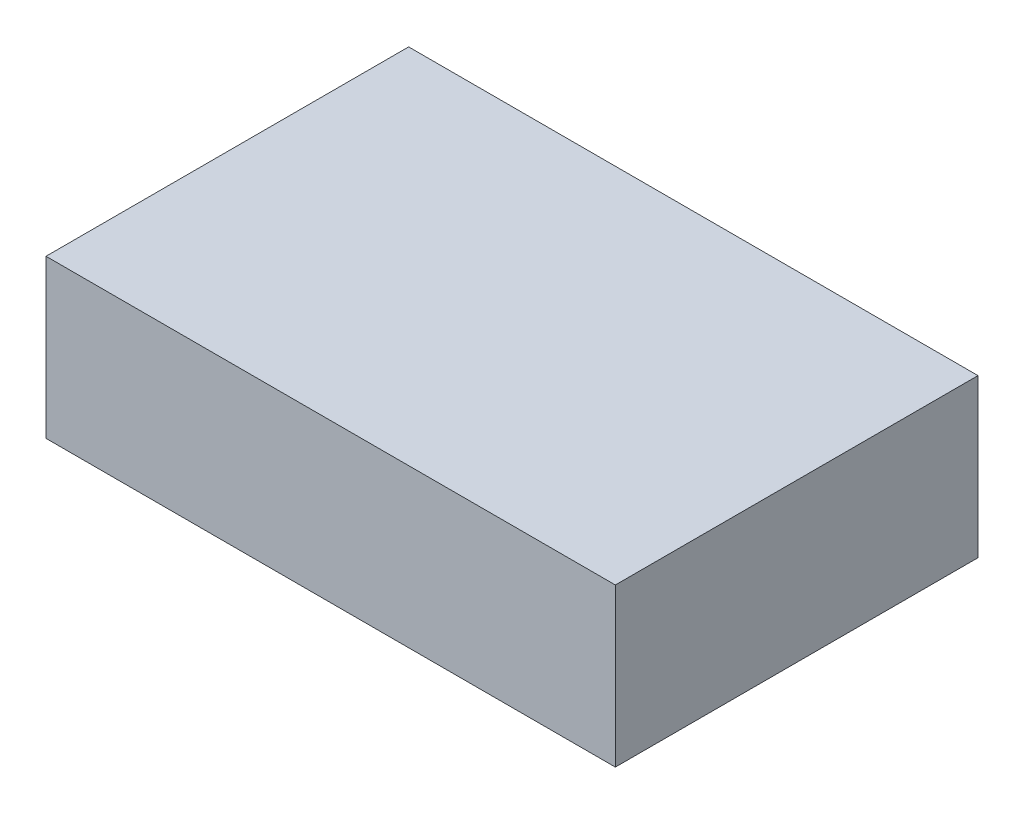
ISO-10303-21;
HEADER;
FILE_DESCRIPTION(('STEP AP214'),'2;1');
FILE_NAME('part.step','',(''),(''),'','','');
FILE_SCHEMA(('AUTOMOTIVE_DESIGN { 1 0 10303 214 1 1 1 1 }'));
ENDSEC;
DATA;
#1=APPLICATION_CONTEXT('core data for automotive mechanical design processes');
#2=APPLICATION_PROTOCOL_DEFINITION('international standard','automotive_design',2000,#1);
#3=PRODUCT_CONTEXT('',#1,'mechanical');
#4=PRODUCT('Part','Part','',(#3));
#5=PRODUCT_RELATED_PRODUCT_CATEGORY('part','',(#4));
#6=PRODUCT_DEFINITION_FORMATION('','',#4);
#7=PRODUCT_DEFINITION_CONTEXT('part definition',#1,'design');
#8=PRODUCT_DEFINITION('design','',#6,#7);
#9=PRODUCT_DEFINITION_SHAPE('','',#8);
#10=(LENGTH_UNIT() NAMED_UNIT(*) SI_UNIT(.MILLI.,.METRE.));
#11=(NAMED_UNIT(*) PLANE_ANGLE_UNIT() SI_UNIT($,.RADIAN.));
#12=(NAMED_UNIT(*) SI_UNIT($,.STERADIAN.) SOLID_ANGLE_UNIT());
#13=UNCERTAINTY_MEASURE_WITH_UNIT(LENGTH_MEASURE(1.E-05),#10,'distance_accuracy_value','');
#14=(GEOMETRIC_REPRESENTATION_CONTEXT(3) GLOBAL_UNCERTAINTY_ASSIGNED_CONTEXT((#13)) GLOBAL_UNIT_ASSIGNED_CONTEXT((#10,
#11,#12)) REPRESENTATION_CONTEXT('',''));
#15=CARTESIAN_POINT('',(0.,0.,0.));
#16=DIRECTION('',(0.,0.,1.));
#17=DIRECTION('',(1.,0.,0.));
#18=AXIS2_PLACEMENT_3D('',#15,#16,#17);
#19=CARTESIAN_POINT('',(0.,87.,0.));
#20=DIRECTION('',(0.,0.,-1.));
#21=DIRECTION('',(-1.,0.,0.));
#22=AXIS2_PLACEMENT_3D('',#19,#20,#21);
#23=PLANE('',#22);
#24=DIRECTION('',(1.,0.,0.));
#25=VECTOR('',#24,1.);
#26=CARTESIAN_POINT('',(0.,0.,0.));
#27=LINE('',#26,#25);
#28=CARTESIAN_POINT('',(0.,0.,0.));
#29=VERTEX_POINT('',#28);
#30=CARTESIAN_POINT('',(314.,0.,0.));
#31=VERTEX_POINT('',#30);
#32=EDGE_CURVE('E99',#29,#31,#27,.T.);
#33=ORIENTED_EDGE('',*,*,#32,.T.);
#34=DIRECTION('',(0.,-1.,0.));
#35=VECTOR('',#34,1.);
#36=CARTESIAN_POINT('',(314.,87.,0.));
#37=LINE('',#36,#35);
#38=CARTESIAN_POINT('',(314.,87.,0.));
#39=VERTEX_POINT('',#38);
#40=EDGE_CURVE('E11',#39,#31,#37,.T.);
#41=ORIENTED_EDGE('',*,*,#40,.F.);
#42=DIRECTION('',(1.,0.,0.));
#43=VECTOR('',#42,1.);
#44=CARTESIAN_POINT('',(0.,87.,0.));
#45=LINE('',#44,#43);
#46=CARTESIAN_POINT('',(0.,87.,0.));
#47=VERTEX_POINT('',#46);
#48=EDGE_CURVE('E85',#47,#39,#45,.T.);
#49=ORIENTED_EDGE('',*,*,#48,.F.);
#50=DIRECTION('',(0.,-1.,0.));
#51=VECTOR('',#50,1.);
#52=CARTESIAN_POINT('',(0.,87.,0.));
#53=LINE('',#52,#51);
#54=EDGE_CURVE('E52',#47,#29,#53,.T.);
#55=ORIENTED_EDGE('',*,*,#54,.T.);
#56=EDGE_LOOP('',(#33,#41,#49,#55));
#57=FACE_BOUND('',#56,.T.);
#58=ADVANCED_FACE('F36',(#57),#23,.F.);
#59=CARTESIAN_POINT('',(314.,87.,0.));
#60=DIRECTION('',(-1.,0.,0.));
#61=DIRECTION('',(0.,0.,1.));
#62=AXIS2_PLACEMENT_3D('',#59,#60,#61);
#63=PLANE('',#62);
#64=DIRECTION('',(0.,0.,-1.));
#65=VECTOR('',#64,1.);
#66=CARTESIAN_POINT('',(314.,0.,0.));
#67=LINE('',#66,#65);
#68=CARTESIAN_POINT('',(314.,0.,-200.));
#69=VERTEX_POINT('',#68);
#70=EDGE_CURVE('E90',#31,#69,#67,.T.);
#71=ORIENTED_EDGE('',*,*,#70,.T.);
#72=DIRECTION('',(0.,-1.,0.));
#73=VECTOR('',#72,1.);
#74=CARTESIAN_POINT('',(314.,87.,-200.));
#75=LINE('',#74,#73);
#76=CARTESIAN_POINT('',(314.,87.,-200.));
#77=VERTEX_POINT('',#76);
#78=EDGE_CURVE('E44',#77,#69,#75,.T.);
#79=ORIENTED_EDGE('',*,*,#78,.F.);
#80=DIRECTION('',(0.,0.,-1.));
#81=VECTOR('',#80,1.);
#82=CARTESIAN_POINT('',(314.,87.,0.));
#83=LINE('',#82,#81);
#84=EDGE_CURVE('E77',#39,#77,#83,.T.);
#85=ORIENTED_EDGE('',*,*,#84,.F.);
#86=ORIENTED_EDGE('',*,*,#40,.T.);
#87=EDGE_LOOP('',(#71,#79,#85,#86));
#88=FACE_BOUND('',#87,.T.);
#89=ADVANCED_FACE('F89',(#88),#63,.F.);
#90=CARTESIAN_POINT('',(0.,87.,-200.));
#91=DIRECTION('',(0.,0.,-1.));
#92=DIRECTION('',(-1.,0.,0.));
#93=AXIS2_PLACEMENT_3D('',#90,#91,#92);
#94=PLANE('',#93);
#95=DIRECTION('',(1.,0.,0.));
#96=VECTOR('',#95,1.);
#97=CARTESIAN_POINT('',(0.,0.,-200.));
#98=LINE('',#97,#96);
#99=CARTESIAN_POINT('',(0.,0.,-200.));
#100=VERTEX_POINT('',#99);
#101=EDGE_CURVE('E102',#100,#69,#98,.T.);
#102=ORIENTED_EDGE('',*,*,#101,.F.);
#103=DIRECTION('',(0.,-1.,0.));
#104=VECTOR('',#103,1.);
#105=CARTESIAN_POINT('',(0.,87.,-200.));
#106=LINE('',#105,#104);
#107=CARTESIAN_POINT('',(0.,87.,-200.));
#108=VERTEX_POINT('',#107);
#109=EDGE_CURVE('E66',#108,#100,#106,.T.);
#110=ORIENTED_EDGE('',*,*,#109,.F.);
#111=DIRECTION('',(1.,0.,0.));
#112=VECTOR('',#111,1.);
#113=CARTESIAN_POINT('',(0.,87.,-200.));
#114=LINE('',#113,#112);
#115=EDGE_CURVE('E84',#108,#77,#114,.T.);
#116=ORIENTED_EDGE('',*,*,#115,.T.);
#117=ORIENTED_EDGE('',*,*,#78,.T.);
#118=EDGE_LOOP('',(#102,#110,#116,#117));
#119=FACE_BOUND('',#118,.T.);
#120=ADVANCED_FACE('F93',(#119),#94,.T.);
#121=CARTESIAN_POINT('',(0.,87.,0.));
#122=DIRECTION('',(-1.,0.,0.));
#123=DIRECTION('',(0.,0.,1.));
#124=AXIS2_PLACEMENT_3D('',#121,#122,#123);
#125=PLANE('',#124);
#126=DIRECTION('',(0.,0.,-1.));
#127=VECTOR('',#126,1.);
#128=CARTESIAN_POINT('',(0.,0.,0.));
#129=LINE('',#128,#127);
#130=EDGE_CURVE('E104',#29,#100,#129,.T.);
#131=ORIENTED_EDGE('',*,*,#130,.F.);
#132=ORIENTED_EDGE('',*,*,#54,.F.);
#133=DIRECTION('',(0.,0.,-1.));
#134=VECTOR('',#133,1.);
#135=CARTESIAN_POINT('',(0.,87.,0.));
#136=LINE('',#135,#134);
#137=EDGE_CURVE('E94',#47,#108,#136,.T.);
#138=ORIENTED_EDGE('',*,*,#137,.T.);
#139=ORIENTED_EDGE('',*,*,#109,.T.);
#140=EDGE_LOOP('',(#131,#132,#138,#139));
#141=FACE_BOUND('',#140,.T.);
#142=ADVANCED_FACE('F110',(#141),#125,.T.);
#143=CARTESIAN_POINT('',(0.,87.,0.));
#144=DIRECTION('',(0.,1.,0.));
#145=DIRECTION('',(0.,0.,1.));
#146=AXIS2_PLACEMENT_3D('',#143,#144,#145);
#147=PLANE('',#146);
#148=ORIENTED_EDGE('',*,*,#48,.T.);
#149=ORIENTED_EDGE('',*,*,#84,.T.);
#150=ORIENTED_EDGE('',*,*,#115,.F.);
#151=ORIENTED_EDGE('',*,*,#137,.F.);
#152=EDGE_LOOP('',(#148,#149,#150,#151));
#153=FACE_BOUND('',#152,.T.);
#154=ADVANCED_FACE('F81',(#153),#147,.T.);
#155=CARTESIAN_POINT('',(0.,0.,0.));
#156=DIRECTION('',(0.,1.,0.));
#157=DIRECTION('',(0.,0.,1.));
#158=AXIS2_PLACEMENT_3D('',#155,#156,#157);
#159=PLANE('',#158);
#160=ORIENTED_EDGE('',*,*,#32,.F.);
#161=ORIENTED_EDGE('',*,*,#130,.T.);
#162=ORIENTED_EDGE('',*,*,#101,.T.);
#163=ORIENTED_EDGE('',*,*,#70,.F.);
#164=EDGE_LOOP('',(#160,#161,#162,#163));
#165=FACE_BOUND('',#164,.T.);
#166=ADVANCED_FACE('F109',(#165),#159,.F.);
#167=CLOSED_SHELL('',(#58,#89,#120,#142,#154,#166));
#168=MANIFOLD_SOLID_BREP('B2',#167);
#169=ADVANCED_BREP_SHAPE_REPRESENTATION('',(#18,#168),#14);
#170=SHAPE_DEFINITION_REPRESENTATION(#9,#169);
ENDSEC;
END-ISO-10303-21;
